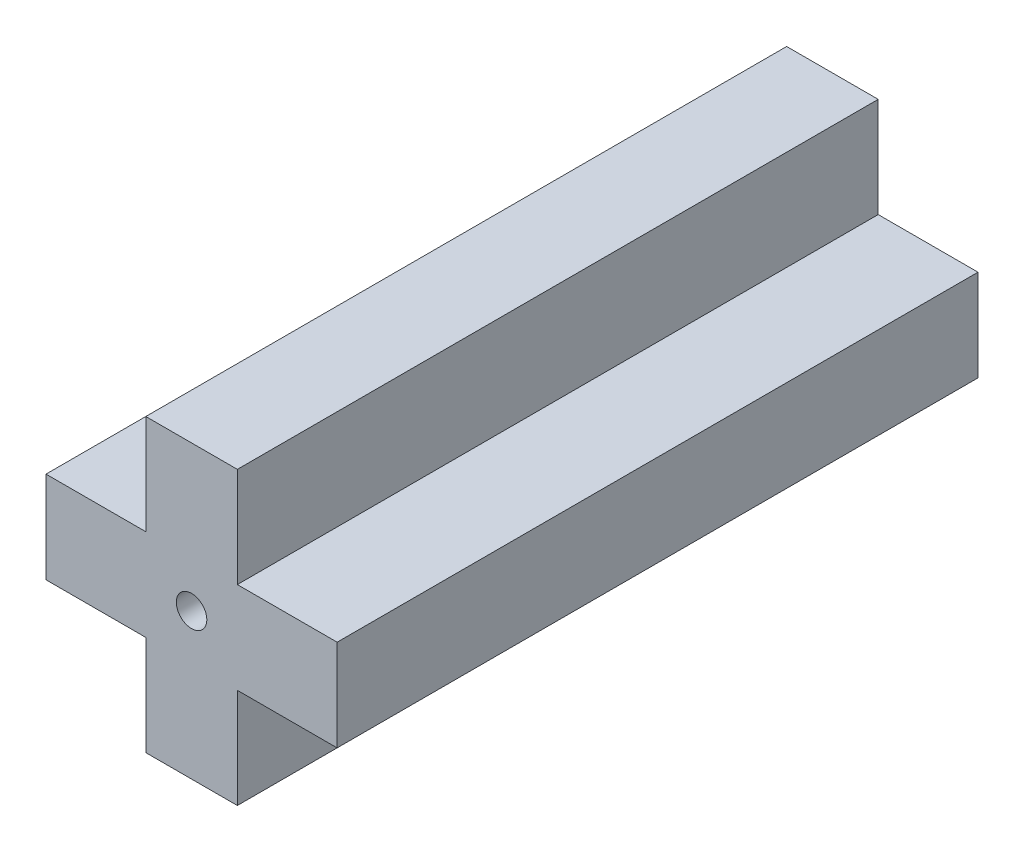
ISO-10303-21;
HEADER;
FILE_DESCRIPTION(('STEP AP214'),'2;1');
FILE_NAME('part.step','',(''),(''),'','','');
FILE_SCHEMA(('AUTOMOTIVE_DESIGN { 1 0 10303 214 1 1 1 1 }'));
ENDSEC;
DATA;
#1=APPLICATION_CONTEXT('core data for automotive mechanical design processes');
#2=APPLICATION_PROTOCOL_DEFINITION('international standard','automotive_design',2000,#1);
#3=PRODUCT_CONTEXT('',#1,'mechanical');
#4=PRODUCT('Part','Part','',(#3));
#5=PRODUCT_RELATED_PRODUCT_CATEGORY('part','',(#4));
#6=PRODUCT_DEFINITION_FORMATION('','',#4);
#7=PRODUCT_DEFINITION_CONTEXT('part definition',#1,'design');
#8=PRODUCT_DEFINITION('design','',#6,#7);
#9=PRODUCT_DEFINITION_SHAPE('','',#8);
#10=(LENGTH_UNIT() NAMED_UNIT(*) SI_UNIT(.MILLI.,.METRE.));
#11=(NAMED_UNIT(*) PLANE_ANGLE_UNIT() SI_UNIT($,.RADIAN.));
#12=(NAMED_UNIT(*) SI_UNIT($,.STERADIAN.) SOLID_ANGLE_UNIT());
#13=UNCERTAINTY_MEASURE_WITH_UNIT(LENGTH_MEASURE(1.E-05),#10,'distance_accuracy_value','');
#14=(GEOMETRIC_REPRESENTATION_CONTEXT(3) GLOBAL_UNCERTAINTY_ASSIGNED_CONTEXT((#13)) GLOBAL_UNIT_ASSIGNED_CONTEXT((#10,
#11,#12)) REPRESENTATION_CONTEXT('',''));
#15=CARTESIAN_POINT('',(0.,0.,0.));
#16=DIRECTION('',(0.,0.,1.));
#17=DIRECTION('',(1.,0.,0.));
#18=AXIS2_PLACEMENT_3D('',#15,#16,#17);
#19=CARTESIAN_POINT('',(0.,0.,21.));
#20=DIRECTION('',(0.,0.,-1.));
#21=DIRECTION('',(-1.,0.,0.));
#22=AXIS2_PLACEMENT_3D('',#19,#20,#21);
#23=PLANE('',#22);
#24=DIRECTION('',(0.,1.,0.));
#25=VECTOR('',#24,1.);
#26=CARTESIAN_POINT('',(1.5,-3.27,21.));
#27=LINE('',#26,#25);
#28=CARTESIAN_POINT('',(1.5,-3.27,21.));
#29=VERTEX_POINT('',#28);
#30=CARTESIAN_POINT('',(1.5,0.,21.));
#31=VERTEX_POINT('',#30);
#32=EDGE_CURVE('E181',#29,#31,#27,.T.);
#33=ORIENTED_EDGE('',*,*,#32,.T.);
#34=DIRECTION('',(1.,0.,0.));
#35=VECTOR('',#34,1.);
#36=CARTESIAN_POINT('',(1.5,0.,21.));
#37=LINE('',#36,#35);
#38=CARTESIAN_POINT('',(4.77,0.,21.));
#39=VERTEX_POINT('',#38);
#40=EDGE_CURVE('E109',#31,#39,#37,.T.);
#41=ORIENTED_EDGE('',*,*,#40,.T.);
#42=DIRECTION('',(0.,1.,0.));
#43=VECTOR('',#42,1.);
#44=CARTESIAN_POINT('',(4.77,0.,21.));
#45=LINE('',#44,#43);
#46=CARTESIAN_POINT('',(4.77,3.,21.));
#47=VERTEX_POINT('',#46);
#48=EDGE_CURVE('E208',#39,#47,#45,.T.);
#49=ORIENTED_EDGE('',*,*,#48,.T.);
#50=DIRECTION('',(-1.,0.,0.));
#51=VECTOR('',#50,1.);
#52=CARTESIAN_POINT('',(4.77,3.,21.));
#53=LINE('',#52,#51);
#54=CARTESIAN_POINT('',(1.5,3.,21.));
#55=VERTEX_POINT('',#54);
#56=EDGE_CURVE('E227',#47,#55,#53,.T.);
#57=ORIENTED_EDGE('',*,*,#56,.T.);
#58=DIRECTION('',(0.,1.,0.));
#59=VECTOR('',#58,1.);
#60=CARTESIAN_POINT('',(1.5,3.,21.));
#61=LINE('',#60,#59);
#62=CARTESIAN_POINT('',(1.5,6.27,21.));
#63=VERTEX_POINT('',#62);
#64=EDGE_CURVE('E224',#55,#63,#61,.T.);
#65=ORIENTED_EDGE('',*,*,#64,.T.);
#66=DIRECTION('',(-1.,0.,0.));
#67=VECTOR('',#66,1.);
#68=CARTESIAN_POINT('',(1.5,6.27,21.));
#69=LINE('',#68,#67);
#70=CARTESIAN_POINT('',(-1.5,6.27,21.));
#71=VERTEX_POINT('',#70);
#72=EDGE_CURVE('E226',#63,#71,#69,.T.);
#73=ORIENTED_EDGE('',*,*,#72,.T.);
#74=DIRECTION('',(0.,-1.,0.));
#75=VECTOR('',#74,1.);
#76=CARTESIAN_POINT('',(-1.5,6.27,21.));
#77=LINE('',#76,#75);
#78=CARTESIAN_POINT('',(-1.5,3.,21.));
#79=VERTEX_POINT('',#78);
#80=EDGE_CURVE('E229',#71,#79,#77,.T.);
#81=ORIENTED_EDGE('',*,*,#80,.T.);
#82=DIRECTION('',(-1.,0.,0.));
#83=VECTOR('',#82,1.);
#84=CARTESIAN_POINT('',(-1.5,3.,21.));
#85=LINE('',#84,#83);
#86=CARTESIAN_POINT('',(-4.77,3.,21.));
#87=VERTEX_POINT('',#86);
#88=EDGE_CURVE('E235',#79,#87,#85,.T.);
#89=ORIENTED_EDGE('',*,*,#88,.T.);
#90=DIRECTION('',(0.,-1.,0.));
#91=VECTOR('',#90,1.);
#92=CARTESIAN_POINT('',(-4.77,3.,21.));
#93=LINE('',#92,#91);
#94=CARTESIAN_POINT('',(-4.77,0.,21.));
#95=VERTEX_POINT('',#94);
#96=EDGE_CURVE('E140',#87,#95,#93,.T.);
#97=ORIENTED_EDGE('',*,*,#96,.T.);
#98=DIRECTION('',(1.,0.,0.));
#99=VECTOR('',#98,1.);
#100=CARTESIAN_POINT('',(-4.77,0.,21.));
#101=LINE('',#100,#99);
#102=CARTESIAN_POINT('',(-1.5,0.,21.));
#103=VERTEX_POINT('',#102);
#104=EDGE_CURVE('E134',#95,#103,#101,.T.);
#105=ORIENTED_EDGE('',*,*,#104,.T.);
#106=DIRECTION('',(0.,-1.,0.));
#107=VECTOR('',#106,1.);
#108=CARTESIAN_POINT('',(-1.5,0.,21.));
#109=LINE('',#108,#107);
#110=CARTESIAN_POINT('',(-1.5,-3.27,21.));
#111=VERTEX_POINT('',#110);
#112=EDGE_CURVE('E138',#103,#111,#109,.T.);
#113=ORIENTED_EDGE('',*,*,#112,.T.);
#114=DIRECTION('',(1.,0.,0.));
#115=VECTOR('',#114,1.);
#116=CARTESIAN_POINT('',(-1.5,-3.27,21.));
#117=LINE('',#116,#115);
#118=EDGE_CURVE('E54',#111,#29,#117,.T.);
#119=ORIENTED_EDGE('',*,*,#118,.T.);
#120=EDGE_LOOP('',(#33,#41,#49,#57,#65,#73,#81,#89,#97,#105,#113,#119));
#121=FACE_BOUND('',#120,.T.);
#122=CARTESIAN_POINT('',(0.,1.5,21.));
#123=DIRECTION('',(0.,0.,1.));
#124=DIRECTION('',(1.,0.,0.));
#125=AXIS2_PLACEMENT_3D('',#122,#123,#124);
#126=CIRCLE('',#125,0.5);
#127=CARTESIAN_POINT('',(0.5,1.5,21.));
#128=VERTEX_POINT('',#127);
#129=EDGE_CURVE('E162',#128,#128,#126,.T.);
#130=ORIENTED_EDGE('',*,*,#129,.F.);
#131=EDGE_LOOP('',(#130));
#132=FACE_BOUND('',#131,.T.);
#133=ADVANCED_FACE('F37',(#121,#132),#23,.F.);
#134=CARTESIAN_POINT('',(0.,0.,0.));
#135=DIRECTION('',(0.,0.,-1.));
#136=DIRECTION('',(-1.,0.,0.));
#137=AXIS2_PLACEMENT_3D('',#134,#135,#136);
#138=PLANE('',#137);
#139=DIRECTION('',(0.,1.,0.));
#140=VECTOR('',#139,1.);
#141=CARTESIAN_POINT('',(1.5,-3.27,0.));
#142=LINE('',#141,#140);
#143=CARTESIAN_POINT('',(1.5,-3.27,0.));
#144=VERTEX_POINT('',#143);
#145=CARTESIAN_POINT('',(1.5,0.,0.));
#146=VERTEX_POINT('',#145);
#147=EDGE_CURVE('E158',#144,#146,#142,.T.);
#148=ORIENTED_EDGE('',*,*,#147,.F.);
#149=DIRECTION('',(1.,0.,0.));
#150=VECTOR('',#149,1.);
#151=CARTESIAN_POINT('',(-1.5,-3.27,0.));
#152=LINE('',#151,#150);
#153=CARTESIAN_POINT('',(-1.5,-3.27,0.));
#154=VERTEX_POINT('',#153);
#155=EDGE_CURVE('E101',#154,#144,#152,.T.);
#156=ORIENTED_EDGE('',*,*,#155,.F.);
#157=DIRECTION('',(0.,-1.,0.));
#158=VECTOR('',#157,1.);
#159=CARTESIAN_POINT('',(-1.5,0.,0.));
#160=LINE('',#159,#158);
#161=CARTESIAN_POINT('',(-1.5,0.,0.));
#162=VERTEX_POINT('',#161);
#163=EDGE_CURVE('E95',#162,#154,#160,.T.);
#164=ORIENTED_EDGE('',*,*,#163,.F.);
#165=DIRECTION('',(1.,0.,0.));
#166=VECTOR('',#165,1.);
#167=CARTESIAN_POINT('',(-4.77,0.,0.));
#168=LINE('',#167,#166);
#169=CARTESIAN_POINT('',(-4.77,0.,0.));
#170=VERTEX_POINT('',#169);
#171=EDGE_CURVE('E148',#170,#162,#168,.T.);
#172=ORIENTED_EDGE('',*,*,#171,.F.);
#173=DIRECTION('',(0.,-1.,0.));
#174=VECTOR('',#173,1.);
#175=CARTESIAN_POINT('',(-4.77,3.,0.));
#176=LINE('',#175,#174);
#177=CARTESIAN_POINT('',(-4.77,3.,0.));
#178=VERTEX_POINT('',#177);
#179=EDGE_CURVE('E176',#178,#170,#176,.T.);
#180=ORIENTED_EDGE('',*,*,#179,.F.);
#181=DIRECTION('',(-1.,0.,0.));
#182=VECTOR('',#181,1.);
#183=CARTESIAN_POINT('',(-1.5,3.,0.));
#184=LINE('',#183,#182);
#185=CARTESIAN_POINT('',(-1.5,3.,0.));
#186=VERTEX_POINT('',#185);
#187=EDGE_CURVE('E174',#186,#178,#184,.T.);
#188=ORIENTED_EDGE('',*,*,#187,.F.);
#189=DIRECTION('',(0.,-1.,0.));
#190=VECTOR('',#189,1.);
#191=CARTESIAN_POINT('',(-1.5,6.27,0.));
#192=LINE('',#191,#190);
#193=CARTESIAN_POINT('',(-1.5,6.27,0.));
#194=VERTEX_POINT('',#193);
#195=EDGE_CURVE('E172',#194,#186,#192,.T.);
#196=ORIENTED_EDGE('',*,*,#195,.F.);
#197=DIRECTION('',(-1.,0.,0.));
#198=VECTOR('',#197,1.);
#199=CARTESIAN_POINT('',(1.5,6.27,0.));
#200=LINE('',#199,#198);
#201=CARTESIAN_POINT('',(1.5,6.27,0.));
#202=VERTEX_POINT('',#201);
#203=EDGE_CURVE('E170',#202,#194,#200,.T.);
#204=ORIENTED_EDGE('',*,*,#203,.F.);
#205=DIRECTION('',(0.,1.,0.));
#206=VECTOR('',#205,1.);
#207=CARTESIAN_POINT('',(1.5,3.,0.));
#208=LINE('',#207,#206);
#209=CARTESIAN_POINT('',(1.5,3.,0.));
#210=VERTEX_POINT('',#209);
#211=EDGE_CURVE('E168',#210,#202,#208,.T.);
#212=ORIENTED_EDGE('',*,*,#211,.F.);
#213=DIRECTION('',(-1.,0.,0.));
#214=VECTOR('',#213,1.);
#215=CARTESIAN_POINT('',(4.77,3.,0.));
#216=LINE('',#215,#214);
#217=CARTESIAN_POINT('',(4.77,3.,0.));
#218=VERTEX_POINT('',#217);
#219=EDGE_CURVE('E166',#218,#210,#216,.T.);
#220=ORIENTED_EDGE('',*,*,#219,.F.);
#221=DIRECTION('',(0.,1.,0.));
#222=VECTOR('',#221,1.);
#223=CARTESIAN_POINT('',(4.77,0.,0.));
#224=LINE('',#223,#222);
#225=CARTESIAN_POINT('',(4.77,0.,0.));
#226=VERTEX_POINT('',#225);
#227=EDGE_CURVE('E164',#226,#218,#224,.T.);
#228=ORIENTED_EDGE('',*,*,#227,.F.);
#229=DIRECTION('',(1.,0.,0.));
#230=VECTOR('',#229,1.);
#231=CARTESIAN_POINT('',(1.5,0.,0.));
#232=LINE('',#231,#230);
#233=EDGE_CURVE('E161',#146,#226,#232,.T.);
#234=ORIENTED_EDGE('',*,*,#233,.F.);
#235=EDGE_LOOP('',(#148,#156,#164,#172,#180,#188,#196,#204,#212,#220,#228,#234));
#236=FACE_BOUND('',#235,.T.);
#237=CARTESIAN_POINT('',(0.,1.5,0.));
#238=DIRECTION('',(0.,0.,1.));
#239=DIRECTION('',(1.,0.,0.));
#240=AXIS2_PLACEMENT_3D('',#237,#238,#239);
#241=CIRCLE('',#240,0.5);
#242=CARTESIAN_POINT('',(0.5,1.5,0.));
#243=VERTEX_POINT('',#242);
#244=EDGE_CURVE('E382',#243,#243,#241,.T.);
#245=ORIENTED_EDGE('',*,*,#244,.T.);
#246=EDGE_LOOP('',(#245));
#247=FACE_BOUND('',#246,.T.);
#248=ADVANCED_FACE('F212',(#236,#247),#138,.T.);
#249=CARTESIAN_POINT('',(1.5,-3.27,21.));
#250=DIRECTION('',(-1.,0.,0.));
#251=DIRECTION('',(0.,0.,1.));
#252=AXIS2_PLACEMENT_3D('',#249,#250,#251);
#253=PLANE('',#252);
#254=ORIENTED_EDGE('',*,*,#147,.T.);
#255=DIRECTION('',(0.,0.,-1.));
#256=VECTOR('',#255,1.);
#257=CARTESIAN_POINT('',(1.5,0.,21.));
#258=LINE('',#257,#256);
#259=EDGE_CURVE('E11',#31,#146,#258,.T.);
#260=ORIENTED_EDGE('',*,*,#259,.F.);
#261=ORIENTED_EDGE('',*,*,#32,.F.);
#262=DIRECTION('',(0.,0.,-1.));
#263=VECTOR('',#262,1.);
#264=CARTESIAN_POINT('',(1.5,-3.27,21.));
#265=LINE('',#264,#263);
#266=EDGE_CURVE('E154',#29,#144,#265,.T.);
#267=ORIENTED_EDGE('',*,*,#266,.T.);
#268=EDGE_LOOP('',(#254,#260,#261,#267));
#269=FACE_BOUND('',#268,.T.);
#270=ADVANCED_FACE('F39',(#269),#253,.F.);
#271=CARTESIAN_POINT('',(1.5,0.,21.));
#272=DIRECTION('',(0.,1.,0.));
#273=DIRECTION('',(-1.,0.,0.));
#274=AXIS2_PLACEMENT_3D('',#271,#272,#273);
#275=PLANE('',#274);
#276=ORIENTED_EDGE('',*,*,#233,.T.);
#277=DIRECTION('',(0.,0.,-1.));
#278=VECTOR('',#277,1.);
#279=CARTESIAN_POINT('',(4.77,0.,21.));
#280=LINE('',#279,#278);
#281=EDGE_CURVE('E46',#39,#226,#280,.T.);
#282=ORIENTED_EDGE('',*,*,#281,.F.);
#283=ORIENTED_EDGE('',*,*,#40,.F.);
#284=ORIENTED_EDGE('',*,*,#259,.T.);
#285=EDGE_LOOP('',(#276,#282,#283,#284));
#286=FACE_BOUND('',#285,.T.);
#287=ADVANCED_FACE('F269',(#286),#275,.F.);
#288=CARTESIAN_POINT('',(4.77,0.,21.));
#289=DIRECTION('',(-1.,0.,0.));
#290=DIRECTION('',(0.,-1.,0.));
#291=AXIS2_PLACEMENT_3D('',#288,#289,#290);
#292=PLANE('',#291);
#293=ORIENTED_EDGE('',*,*,#227,.T.);
#294=DIRECTION('',(0.,0.,-1.));
#295=VECTOR('',#294,1.);
#296=CARTESIAN_POINT('',(4.77,3.,21.));
#297=LINE('',#296,#295);
#298=EDGE_CURVE('E200',#47,#218,#297,.T.);
#299=ORIENTED_EDGE('',*,*,#298,.F.);
#300=ORIENTED_EDGE('',*,*,#48,.F.);
#301=ORIENTED_EDGE('',*,*,#281,.T.);
#302=EDGE_LOOP('',(#293,#299,#300,#301));
#303=FACE_BOUND('',#302,.T.);
#304=ADVANCED_FACE('F206',(#303),#292,.F.);
#305=CARTESIAN_POINT('',(4.77,3.,21.));
#306=DIRECTION('',(0.,-1.,0.));
#307=DIRECTION('',(1.,0.,0.));
#308=AXIS2_PLACEMENT_3D('',#305,#306,#307);
#309=PLANE('',#308);
#310=ORIENTED_EDGE('',*,*,#219,.T.);
#311=DIRECTION('',(0.,0.,-1.));
#312=VECTOR('',#311,1.);
#313=CARTESIAN_POINT('',(1.5,3.,21.));
#314=LINE('',#313,#312);
#315=EDGE_CURVE('E197',#55,#210,#314,.T.);
#316=ORIENTED_EDGE('',*,*,#315,.F.);
#317=ORIENTED_EDGE('',*,*,#56,.F.);
#318=ORIENTED_EDGE('',*,*,#298,.T.);
#319=EDGE_LOOP('',(#310,#316,#317,#318));
#320=FACE_BOUND('',#319,.T.);
#321=ADVANCED_FACE('F218',(#320),#309,.F.);
#322=CARTESIAN_POINT('',(1.5,3.,21.));
#323=DIRECTION('',(-1.,0.,0.));
#324=DIRECTION('',(0.,-1.,0.));
#325=AXIS2_PLACEMENT_3D('',#322,#323,#324);
#326=PLANE('',#325);
#327=ORIENTED_EDGE('',*,*,#211,.T.);
#328=DIRECTION('',(0.,0.,-1.));
#329=VECTOR('',#328,1.);
#330=CARTESIAN_POINT('',(1.5,6.27,21.));
#331=LINE('',#330,#329);
#332=EDGE_CURVE('E194',#63,#202,#331,.T.);
#333=ORIENTED_EDGE('',*,*,#332,.F.);
#334=ORIENTED_EDGE('',*,*,#64,.F.);
#335=ORIENTED_EDGE('',*,*,#315,.T.);
#336=EDGE_LOOP('',(#327,#333,#334,#335));
#337=FACE_BOUND('',#336,.T.);
#338=ADVANCED_FACE('F222',(#337),#326,.F.);
#339=CARTESIAN_POINT('',(1.5,6.27,21.));
#340=DIRECTION('',(0.,-1.,0.));
#341=DIRECTION('',(0.,0.,-1.));
#342=AXIS2_PLACEMENT_3D('',#339,#340,#341);
#343=PLANE('',#342);
#344=ORIENTED_EDGE('',*,*,#203,.T.);
#345=DIRECTION('',(0.,0.,-1.));
#346=VECTOR('',#345,1.);
#347=CARTESIAN_POINT('',(-1.5,6.27,21.));
#348=LINE('',#347,#346);
#349=EDGE_CURVE('E191',#71,#194,#348,.T.);
#350=ORIENTED_EDGE('',*,*,#349,.F.);
#351=ORIENTED_EDGE('',*,*,#72,.F.);
#352=ORIENTED_EDGE('',*,*,#332,.T.);
#353=EDGE_LOOP('',(#344,#350,#351,#352));
#354=FACE_BOUND('',#353,.T.);
#355=ADVANCED_FACE('F282',(#354),#343,.F.);
#356=CARTESIAN_POINT('',(-1.5,6.27,21.));
#357=DIRECTION('',(1.,0.,0.));
#358=DIRECTION('',(0.,1.,0.));
#359=AXIS2_PLACEMENT_3D('',#356,#357,#358);
#360=PLANE('',#359);
#361=ORIENTED_EDGE('',*,*,#195,.T.);
#362=DIRECTION('',(0.,0.,-1.));
#363=VECTOR('',#362,1.);
#364=CARTESIAN_POINT('',(-1.5,3.,21.));
#365=LINE('',#364,#363);
#366=EDGE_CURVE('E188',#79,#186,#365,.T.);
#367=ORIENTED_EDGE('',*,*,#366,.F.);
#368=ORIENTED_EDGE('',*,*,#80,.F.);
#369=ORIENTED_EDGE('',*,*,#349,.T.);
#370=EDGE_LOOP('',(#361,#367,#368,#369));
#371=FACE_BOUND('',#370,.T.);
#372=ADVANCED_FACE('F285',(#371),#360,.F.);
#373=CARTESIAN_POINT('',(-1.5,3.,21.));
#374=DIRECTION('',(0.,-1.,0.));
#375=DIRECTION('',(1.,0.,0.));
#376=AXIS2_PLACEMENT_3D('',#373,#374,#375);
#377=PLANE('',#376);
#378=ORIENTED_EDGE('',*,*,#187,.T.);
#379=DIRECTION('',(0.,0.,-1.));
#380=VECTOR('',#379,1.);
#381=CARTESIAN_POINT('',(-4.77,3.,21.));
#382=LINE('',#381,#380);
#383=EDGE_CURVE('E185',#87,#178,#382,.T.);
#384=ORIENTED_EDGE('',*,*,#383,.F.);
#385=ORIENTED_EDGE('',*,*,#88,.F.);
#386=ORIENTED_EDGE('',*,*,#366,.T.);
#387=EDGE_LOOP('',(#378,#384,#385,#386));
#388=FACE_BOUND('',#387,.T.);
#389=ADVANCED_FACE('F241',(#388),#377,.F.);
#390=CARTESIAN_POINT('',(-4.77,3.,21.));
#391=DIRECTION('',(1.,0.,0.));
#392=DIRECTION('',(0.,1.,0.));
#393=AXIS2_PLACEMENT_3D('',#390,#391,#392);
#394=PLANE('',#393);
#395=ORIENTED_EDGE('',*,*,#179,.T.);
#396=DIRECTION('',(0.,0.,-1.));
#397=VECTOR('',#396,1.);
#398=CARTESIAN_POINT('',(-4.77,0.,21.));
#399=LINE('',#398,#397);
#400=EDGE_CURVE('E149',#95,#170,#399,.T.);
#401=ORIENTED_EDGE('',*,*,#400,.F.);
#402=ORIENTED_EDGE('',*,*,#96,.F.);
#403=ORIENTED_EDGE('',*,*,#383,.T.);
#404=EDGE_LOOP('',(#395,#401,#402,#403));
#405=FACE_BOUND('',#404,.T.);
#406=ADVANCED_FACE('F245',(#405),#394,.F.);
#407=CARTESIAN_POINT('',(-4.77,0.,21.));
#408=DIRECTION('',(0.,1.,0.));
#409=DIRECTION('',(-1.,0.,0.));
#410=AXIS2_PLACEMENT_3D('',#407,#408,#409);
#411=PLANE('',#410);
#412=ORIENTED_EDGE('',*,*,#171,.T.);
#413=DIRECTION('',(0.,0.,-1.));
#414=VECTOR('',#413,1.);
#415=CARTESIAN_POINT('',(-1.5,0.,21.));
#416=LINE('',#415,#414);
#417=EDGE_CURVE('E145',#103,#162,#416,.T.);
#418=ORIENTED_EDGE('',*,*,#417,.F.);
#419=ORIENTED_EDGE('',*,*,#104,.F.);
#420=ORIENTED_EDGE('',*,*,#400,.T.);
#421=EDGE_LOOP('',(#412,#418,#419,#420));
#422=FACE_BOUND('',#421,.T.);
#423=ADVANCED_FACE('F146',(#422),#411,.F.);
#424=CARTESIAN_POINT('',(-1.5,0.,21.));
#425=DIRECTION('',(1.,0.,0.));
#426=DIRECTION('',(0.,1.,0.));
#427=AXIS2_PLACEMENT_3D('',#424,#425,#426);
#428=PLANE('',#427);
#429=ORIENTED_EDGE('',*,*,#163,.T.);
#430=DIRECTION('',(0.,0.,-1.));
#431=VECTOR('',#430,1.);
#432=CARTESIAN_POINT('',(-1.5,-3.27,21.));
#433=LINE('',#432,#431);
#434=EDGE_CURVE('E150',#111,#154,#433,.T.);
#435=ORIENTED_EDGE('',*,*,#434,.F.);
#436=ORIENTED_EDGE('',*,*,#112,.F.);
#437=ORIENTED_EDGE('',*,*,#417,.T.);
#438=EDGE_LOOP('',(#429,#435,#436,#437));
#439=FACE_BOUND('',#438,.T.);
#440=ADVANCED_FACE('F152',(#439),#428,.F.);
#441=CARTESIAN_POINT('',(-1.5,-3.27,21.));
#442=DIRECTION('',(0.,1.,0.));
#443=DIRECTION('',(0.,0.,1.));
#444=AXIS2_PLACEMENT_3D('',#441,#442,#443);
#445=PLANE('',#444);
#446=ORIENTED_EDGE('',*,*,#155,.T.);
#447=ORIENTED_EDGE('',*,*,#266,.F.);
#448=ORIENTED_EDGE('',*,*,#118,.F.);
#449=ORIENTED_EDGE('',*,*,#434,.T.);
#450=EDGE_LOOP('',(#446,#447,#448,#449));
#451=FACE_BOUND('',#450,.T.);
#452=ADVANCED_FACE('F249',(#451),#445,.F.);
#453=CARTESIAN_POINT('',(0.,1.5,21.));
#454=DIRECTION('',(0.,0.,-1.));
#455=DIRECTION('',(-1.,0.,0.));
#456=AXIS2_PLACEMENT_3D('',#453,#454,#455);
#457=CYLINDRICAL_SURFACE('',#456,0.5);
#458=ORIENTED_EDGE('',*,*,#129,.T.);
#459=EDGE_LOOP('',(#458));
#460=FACE_BOUND('',#459,.T.);
#461=ORIENTED_EDGE('',*,*,#244,.F.);
#462=EDGE_LOOP('',(#461));
#463=FACE_BOUND('',#462,.T.);
#464=ADVANCED_FACE('F251',(#460,#463),#457,.F.);
#465=CLOSED_SHELL('',(#133,#248,#270,#287,#304,#321,#338,#355,#372,#389,#406,#423,#440,#452,#464));
#466=MANIFOLD_SOLID_BREP('B2',#465);
#467=ADVANCED_BREP_SHAPE_REPRESENTATION('',(#18,#466),#14);
#468=SHAPE_DEFINITION_REPRESENTATION(#9,#467);
ENDSEC;
END-ISO-10303-21;
